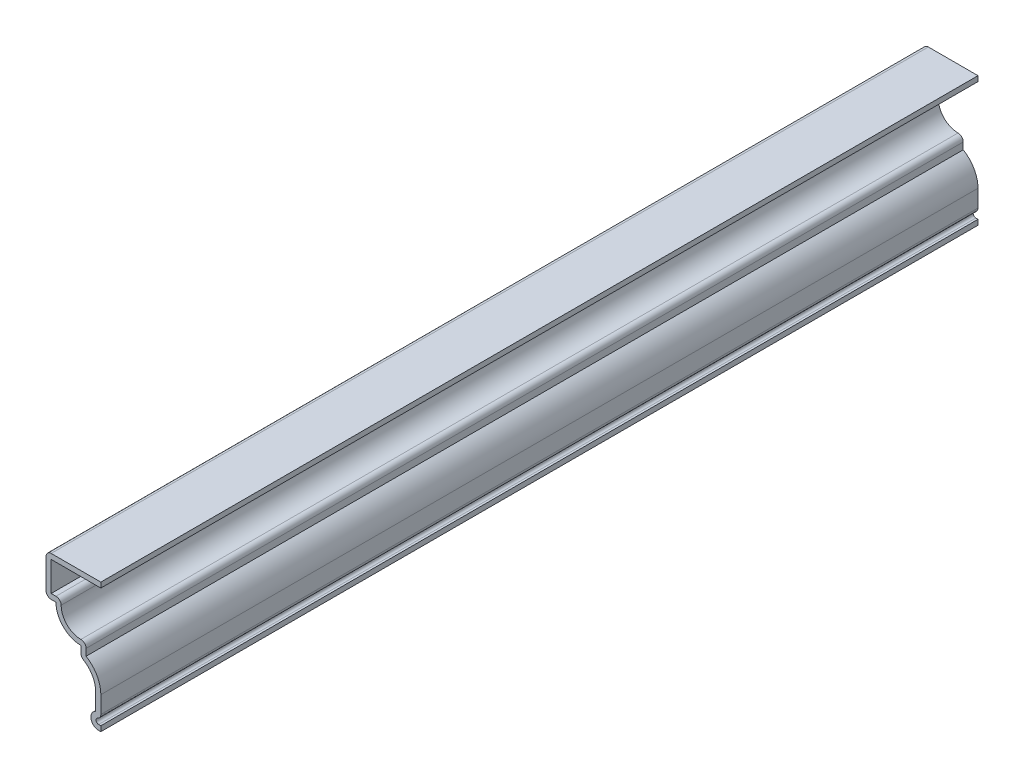
ISO-10303-21;
HEADER;
FILE_DESCRIPTION(('STEP AP214'),'2;1');
FILE_NAME('part.step','',(''),(''),'','','');
FILE_SCHEMA(('AUTOMOTIVE_DESIGN { 1 0 10303 214 1 1 1 1 }'));
ENDSEC;
DATA;
#1=APPLICATION_CONTEXT('core data for automotive mechanical design processes');
#2=APPLICATION_PROTOCOL_DEFINITION('international standard','automotive_design',2000,#1);
#3=PRODUCT_CONTEXT('',#1,'mechanical');
#4=PRODUCT('Part','Part','',(#3));
#5=PRODUCT_RELATED_PRODUCT_CATEGORY('part','',(#4));
#6=PRODUCT_DEFINITION_FORMATION('','',#4);
#7=PRODUCT_DEFINITION_CONTEXT('part definition',#1,'design');
#8=PRODUCT_DEFINITION('design','',#6,#7);
#9=PRODUCT_DEFINITION_SHAPE('','',#8);
#10=(LENGTH_UNIT() NAMED_UNIT(*) SI_UNIT(.MILLI.,.METRE.));
#11=(NAMED_UNIT(*) PLANE_ANGLE_UNIT() SI_UNIT($,.RADIAN.));
#12=(NAMED_UNIT(*) SI_UNIT($,.STERADIAN.) SOLID_ANGLE_UNIT());
#13=UNCERTAINTY_MEASURE_WITH_UNIT(LENGTH_MEASURE(1.E-05),#10,'distance_accuracy_value','');
#14=(GEOMETRIC_REPRESENTATION_CONTEXT(3) GLOBAL_UNCERTAINTY_ASSIGNED_CONTEXT((#13)) GLOBAL_UNIT_ASSIGNED_CONTEXT((#10,
#11,#12)) REPRESENTATION_CONTEXT('',''));
#15=CARTESIAN_POINT('',(0.,0.,0.));
#16=DIRECTION('',(0.,0.,1.));
#17=DIRECTION('',(1.,0.,0.));
#18=AXIS2_PLACEMENT_3D('',#15,#16,#17);
#19=CARTESIAN_POINT('',(-17.4625,39.624,-279.4));
#20=DIRECTION('',(0.,-1.,0.));
#21=DIRECTION('',(0.,0.,-1.));
#22=AXIS2_PLACEMENT_3D('',#19,#20,#21);
#23=PLANE('',#22);
#24=DIRECTION('',(1.,0.,0.));
#25=VECTOR('',#24,1.);
#26=CARTESIAN_POINT('',(-17.4625,39.624,0.));
#27=LINE('',#26,#25);
#28=CARTESIAN_POINT('',(-15.8115,39.624,0.));
#29=VERTEX_POINT('',#28);
#30=CARTESIAN_POINT('',(0.,39.624,0.));
#31=VERTEX_POINT('',#30);
#32=EDGE_CURVE('E281',#29,#31,#27,.T.);
#33=ORIENTED_EDGE('',*,*,#32,.F.);
#34=DIRECTION('',(0.,0.,1.));
#35=VECTOR('',#34,1.);
#36=CARTESIAN_POINT('',(-15.8115,39.624,-279.4));
#37=LINE('',#36,#35);
#38=CARTESIAN_POINT('',(-15.8115,39.624,-279.4));
#39=VERTEX_POINT('',#38);
#40=EDGE_CURVE('E233',#39,#29,#37,.T.);
#41=ORIENTED_EDGE('',*,*,#40,.F.);
#42=DIRECTION('',(1.,0.,0.));
#43=VECTOR('',#42,1.);
#44=CARTESIAN_POINT('',(-17.4625,39.624,-279.4));
#45=LINE('',#44,#43);
#46=CARTESIAN_POINT('',(0.,39.624,-279.4));
#47=VERTEX_POINT('',#46);
#48=EDGE_CURVE('E215',#39,#47,#45,.T.);
#49=ORIENTED_EDGE('',*,*,#48,.T.);
#50=DIRECTION('',(0.,0.,1.));
#51=VECTOR('',#50,1.);
#52=CARTESIAN_POINT('',(0.,39.624,-279.4));
#53=LINE('',#52,#51);
#54=EDGE_CURVE('E223',#47,#31,#53,.T.);
#55=ORIENTED_EDGE('',*,*,#54,.T.);
#56=EDGE_LOOP('',(#33,#41,#49,#55));
#57=FACE_BOUND('',#56,.T.);
#58=ADVANCED_FACE('F35',(#57),#23,.T.);
#59=CARTESIAN_POINT('',(-15.8115,28.575,-279.4));
#60=DIRECTION('',(1.,0.,0.));
#61=DIRECTION('',(0.,0.,-1.));
#62=AXIS2_PLACEMENT_3D('',#59,#60,#61);
#63=PLANE('',#62);
#64=DIRECTION('',(0.,1.,0.));
#65=VECTOR('',#64,1.);
#66=CARTESIAN_POINT('',(-15.8115,28.575,0.));
#67=LINE('',#66,#65);
#68=CARTESIAN_POINT('',(-15.8115,30.226,0.));
#69=VERTEX_POINT('',#68);
#70=EDGE_CURVE('E234',#69,#29,#67,.T.);
#71=ORIENTED_EDGE('',*,*,#70,.F.);
#72=DIRECTION('',(0.,0.,1.));
#73=VECTOR('',#72,1.);
#74=CARTESIAN_POINT('',(-15.8115,30.226,-279.4));
#75=LINE('',#74,#73);
#76=CARTESIAN_POINT('',(-15.8115,30.226,-279.4));
#77=VERTEX_POINT('',#76);
#78=EDGE_CURVE('E326',#77,#69,#75,.T.);
#79=ORIENTED_EDGE('',*,*,#78,.F.);
#80=DIRECTION('',(0.,1.,0.));
#81=VECTOR('',#80,1.);
#82=CARTESIAN_POINT('',(-15.8115,28.575,-279.4));
#83=LINE('',#82,#81);
#84=EDGE_CURVE('E231',#77,#39,#83,.T.);
#85=ORIENTED_EDGE('',*,*,#84,.T.);
#86=ORIENTED_EDGE('',*,*,#40,.T.);
#87=EDGE_LOOP('',(#71,#79,#85,#86));
#88=FACE_BOUND('',#87,.T.);
#89=ADVANCED_FACE('F426',(#88),#63,.T.);
#90=CARTESIAN_POINT('',(-14.2875,30.226,-279.4));
#91=DIRECTION('',(0.,1.,0.));
#92=DIRECTION('',(0.,0.,1.));
#93=AXIS2_PLACEMENT_3D('',#90,#91,#92);
#94=PLANE('',#93);
#95=DIRECTION('',(1.,0.,0.));
#96=VECTOR('',#95,1.);
#97=CARTESIAN_POINT('',(-14.2875,30.226,0.));
#98=LINE('',#97,#96);
#99=CARTESIAN_POINT('',(-14.2875,30.226,0.));
#100=VERTEX_POINT('',#99);
#101=EDGE_CURVE('E237',#100,#69,#98,.F.);
#102=ORIENTED_EDGE('',*,*,#101,.F.);
#103=DIRECTION('',(0.,0.,1.));
#104=VECTOR('',#103,1.);
#105=CARTESIAN_POINT('',(-14.2875,30.226,-279.4));
#106=LINE('',#105,#104);
#107=CARTESIAN_POINT('',(-14.2875,30.226,-279.4));
#108=VERTEX_POINT('',#107);
#109=EDGE_CURVE('E397',#100,#108,#106,.F.);
#110=ORIENTED_EDGE('',*,*,#109,.T.);
#111=DIRECTION('',(1.,0.,0.));
#112=VECTOR('',#111,1.);
#113=CARTESIAN_POINT('',(-14.2875,30.226,-279.4));
#114=LINE('',#113,#112);
#115=EDGE_CURVE('E278',#108,#77,#114,.F.);
#116=ORIENTED_EDGE('',*,*,#115,.T.);
#117=ORIENTED_EDGE('',*,*,#78,.T.);
#118=EDGE_LOOP('',(#102,#110,#116,#117));
#119=FACE_BOUND('',#118,.T.);
#120=ADVANCED_FACE('F518',(#119),#94,.T.);
#121=CARTESIAN_POINT('',(-6.34999999999999,28.575,-279.4));
#122=DIRECTION('',(0.,0.,1.));
#123=DIRECTION('',(1.,0.,0.));
#124=AXIS2_PLACEMENT_3D('',#121,#122,#123);
#125=CYLINDRICAL_SURFACE('',#124,6.2865);
#126=CARTESIAN_POINT('',(-6.34999999999999,28.575,0.));
#127=DIRECTION('',(0.,0.,1.));
#128=DIRECTION('',(1.,0.,0.));
#129=AXIS2_PLACEMENT_3D('',#126,#127,#128);
#130=CIRCLE('',#129,6.2865);
#131=CARTESIAN_POINT('',(-6.34999999999999,22.2885,0.));
#132=VERTEX_POINT('',#131);
#133=CARTESIAN_POINT('',(-12.6365,28.575,0.));
#134=VERTEX_POINT('',#133);
#135=EDGE_CURVE('E320',#132,#134,#130,.F.);
#136=ORIENTED_EDGE('',*,*,#135,.F.);
#137=DIRECTION('',(0.,0.,1.));
#138=VECTOR('',#137,1.);
#139=CARTESIAN_POINT('',(-6.34999999999999,22.2885,-279.4));
#140=LINE('',#139,#138);
#141=CARTESIAN_POINT('',(-6.34999999999999,22.2885,-279.4));
#142=VERTEX_POINT('',#141);
#143=EDGE_CURVE('E395',#132,#142,#140,.F.);
#144=ORIENTED_EDGE('',*,*,#143,.T.);
#145=CARTESIAN_POINT('',(-6.34999999999999,28.575,-279.4));
#146=DIRECTION('',(0.,0.,1.));
#147=DIRECTION('',(1.,0.,0.));
#148=AXIS2_PLACEMENT_3D('',#145,#146,#147);
#149=CIRCLE('',#148,6.2865);
#150=CARTESIAN_POINT('',(-12.6365,28.575,-279.4));
#151=VERTEX_POINT('',#150);
#152=EDGE_CURVE('E275',#142,#151,#149,.F.);
#153=ORIENTED_EDGE('',*,*,#152,.T.);
#154=DIRECTION('',(0.,0.,1.));
#155=VECTOR('',#154,1.);
#156=CARTESIAN_POINT('',(-12.6365,28.575,-279.4));
#157=LINE('',#156,#155);
#158=EDGE_CURVE('E392',#151,#134,#157,.T.);
#159=ORIENTED_EDGE('',*,*,#158,.T.);
#160=EDGE_LOOP('',(#136,#144,#153,#159));
#161=FACE_BOUND('',#160,.T.);
#162=ADVANCED_FACE('F437',(#161),#125,.F.);
#163=CARTESIAN_POINT('',(-4.69899999999999,17.4625,-279.4));
#164=DIRECTION('',(1.,0.,0.));
#165=DIRECTION('',(0.,0.,-1.));
#166=AXIS2_PLACEMENT_3D('',#163,#164,#165);
#167=PLANE('',#166);
#168=DIRECTION('',(0.,1.,0.));
#169=VECTOR('',#168,1.);
#170=CARTESIAN_POINT('',(-4.69899999999999,17.4625,-279.4));
#171=LINE('',#170,#169);
#172=CARTESIAN_POINT('',(-4.699,18.4638646538287,-279.4));
#173=VERTEX_POINT('',#172);
#174=CARTESIAN_POINT('',(-4.69899999999999,20.6375,-279.4));
#175=VERTEX_POINT('',#174);
#176=EDGE_CURVE('E272',#173,#175,#171,.T.);
#177=ORIENTED_EDGE('',*,*,#176,.T.);
#178=DIRECTION('',(0.,0.,1.));
#179=VECTOR('',#178,1.);
#180=CARTESIAN_POINT('',(-4.69899999999999,20.6375,-279.4));
#181=LINE('',#180,#179);
#182=CARTESIAN_POINT('',(-4.69899999999999,20.6375,0.));
#183=VERTEX_POINT('',#182);
#184=EDGE_CURVE('E389',#175,#183,#181,.T.);
#185=ORIENTED_EDGE('',*,*,#184,.T.);
#186=DIRECTION('',(0.,1.,0.));
#187=VECTOR('',#186,1.);
#188=CARTESIAN_POINT('',(-4.69899999999999,17.4625,0.));
#189=LINE('',#188,#187);
#190=CARTESIAN_POINT('',(-4.699,18.4638646538287,0.));
#191=VERTEX_POINT('',#190);
#192=EDGE_CURVE('E317',#191,#183,#189,.T.);
#193=ORIENTED_EDGE('',*,*,#192,.F.);
#194=DIRECTION('',(0.,0.,1.));
#195=VECTOR('',#194,1.);
#196=CARTESIAN_POINT('',(-4.699,18.4638646538287,-279.4));
#197=LINE('',#196,#195);
#198=EDGE_CURVE('E329',#173,#191,#197,.T.);
#199=ORIENTED_EDGE('',*,*,#198,.F.);
#200=EDGE_LOOP('',(#177,#185,#193,#199));
#201=FACE_BOUND('',#200,.T.);
#202=ADVANCED_FACE('F445',(#201),#167,.T.);
#203=CARTESIAN_POINT('',(-9.5885,10.2157059502149,-279.4));
#204=DIRECTION('',(0.,0.,1.));
#205=DIRECTION('',(1.,0.,0.));
#206=AXIS2_PLACEMENT_3D('',#203,#204,#205);
#207=CYLINDRICAL_SURFACE('',#206,9.5885);
#208=CARTESIAN_POINT('',(-9.5885,10.2157059502149,0.));
#209=DIRECTION('',(0.,0.,1.));
#210=DIRECTION('',(1.,0.,0.));
#211=AXIS2_PLACEMENT_3D('',#208,#209,#210);
#212=CIRCLE('',#211,9.5885);
#213=CARTESIAN_POINT('',(0.,10.2157059502149,0.));
#214=VERTEX_POINT('',#213);
#215=EDGE_CURVE('E314',#214,#191,#212,.T.);
#216=ORIENTED_EDGE('',*,*,#215,.F.);
#217=DIRECTION('',(0.,0.,1.));
#218=VECTOR('',#217,1.);
#219=CARTESIAN_POINT('',(0.,10.2157059502149,-279.4));
#220=LINE('',#219,#218);
#221=CARTESIAN_POINT('',(0.,10.2157059502149,-279.4));
#222=VERTEX_POINT('',#221);
#223=EDGE_CURVE('E331',#222,#214,#220,.T.);
#224=ORIENTED_EDGE('',*,*,#223,.F.);
#225=CARTESIAN_POINT('',(-9.5885,10.2157059502149,-279.4));
#226=DIRECTION('',(0.,0.,1.));
#227=DIRECTION('',(1.,0.,0.));
#228=AXIS2_PLACEMENT_3D('',#225,#226,#227);
#229=CIRCLE('',#228,9.5885);
#230=EDGE_CURVE('E269',#222,#173,#229,.T.);
#231=ORIENTED_EDGE('',*,*,#230,.T.);
#232=ORIENTED_EDGE('',*,*,#198,.T.);
#233=EDGE_LOOP('',(#216,#224,#231,#232));
#234=FACE_BOUND('',#233,.T.);
#235=ADVANCED_FACE('F451',(#234),#207,.T.);
#236=CARTESIAN_POINT('',(0.,4.7625,-279.4));
#237=DIRECTION('',(1.,0.,0.));
#238=DIRECTION('',(0.,1.,0.));
#239=AXIS2_PLACEMENT_3D('',#236,#237,#238);
#240=PLANE('',#239);
#241=DIRECTION('',(0.,1.,0.));
#242=VECTOR('',#241,1.);
#243=CARTESIAN_POINT('',(0.,4.7625,0.));
#244=LINE('',#243,#242);
#245=CARTESIAN_POINT('',(0.,4.7625,0.));
#246=VERTEX_POINT('',#245);
#247=EDGE_CURVE('E312',#246,#214,#244,.T.);
#248=ORIENTED_EDGE('',*,*,#247,.F.);
#249=DIRECTION('',(0.,0.,1.));
#250=VECTOR('',#249,1.);
#251=CARTESIAN_POINT('',(0.,4.7625,-279.4));
#252=LINE('',#251,#250);
#253=CARTESIAN_POINT('',(0.,4.7625,-279.4));
#254=VERTEX_POINT('',#253);
#255=EDGE_CURVE('E371',#246,#254,#252,.F.);
#256=ORIENTED_EDGE('',*,*,#255,.T.);
#257=DIRECTION('',(0.,1.,0.));
#258=VECTOR('',#257,1.);
#259=CARTESIAN_POINT('',(0.,4.7625,-279.4));
#260=LINE('',#259,#258);
#261=EDGE_CURVE('E267',#254,#222,#260,.T.);
#262=ORIENTED_EDGE('',*,*,#261,.T.);
#263=ORIENTED_EDGE('',*,*,#223,.T.);
#264=EDGE_LOOP('',(#248,#256,#262,#263));
#265=FACE_BOUND('',#264,.T.);
#266=ADVANCED_FACE('F454',(#265),#240,.T.);
#267=CARTESIAN_POINT('',(-0.698499999999999,2.4765,-279.4));
#268=DIRECTION('',(0.,0.,1.));
#269=DIRECTION('',(1.,0.,0.));
#270=AXIS2_PLACEMENT_3D('',#267,#268,#269);
#271=CYLINDRICAL_SURFACE('',#270,0.8255);
#272=CARTESIAN_POINT('',(-0.698499999999999,2.4765,-279.4));
#273=DIRECTION('',(0.,0.,1.));
#274=DIRECTION('',(1.,0.,0.));
#275=AXIS2_PLACEMENT_3D('',#272,#273,#274);
#276=CIRCLE('',#275,0.8255);
#277=CARTESIAN_POINT('',(-0.698499999999999,1.651,-279.4));
#278=VERTEX_POINT('',#277);
#279=CARTESIAN_POINT('',(-1.016,3.2385,-279.4));
#280=VERTEX_POINT('',#279);
#281=EDGE_CURVE('E264',#278,#280,#276,.F.);
#282=ORIENTED_EDGE('',*,*,#281,.T.);
#283=DIRECTION('',(0.,0.,1.));
#284=VECTOR('',#283,1.);
#285=CARTESIAN_POINT('',(-1.016,3.2385,-279.4));
#286=LINE('',#285,#284);
#287=CARTESIAN_POINT('',(-1.016,3.2385,0.));
#288=VERTEX_POINT('',#287);
#289=EDGE_CURVE('E325',#280,#288,#286,.T.);
#290=ORIENTED_EDGE('',*,*,#289,.T.);
#291=CARTESIAN_POINT('',(-0.698499999999999,2.4765,0.));
#292=DIRECTION('',(0.,0.,1.));
#293=DIRECTION('',(1.,0.,0.));
#294=AXIS2_PLACEMENT_3D('',#291,#292,#293);
#295=CIRCLE('',#294,0.8255);
#296=CARTESIAN_POINT('',(-0.698499999999999,1.651,0.));
#297=VERTEX_POINT('',#296);
#298=EDGE_CURVE('E309',#297,#288,#295,.F.);
#299=ORIENTED_EDGE('',*,*,#298,.F.);
#300=DIRECTION('',(0.,0.,1.));
#301=VECTOR('',#300,1.);
#302=CARTESIAN_POINT('',(-0.698499999999999,1.651,-279.4));
#303=LINE('',#302,#301);
#304=EDGE_CURVE('E334',#278,#297,#303,.T.);
#305=ORIENTED_EDGE('',*,*,#304,.F.);
#306=EDGE_LOOP('',(#282,#290,#299,#305));
#307=FACE_BOUND('',#306,.T.);
#308=ADVANCED_FACE('F463',(#307),#271,.F.);
#309=CARTESIAN_POINT('',(-0.698499999999999,1.651,-279.4));
#310=DIRECTION('',(0.,1.,0.));
#311=DIRECTION('',(0.,0.,1.));
#312=AXIS2_PLACEMENT_3D('',#309,#310,#311);
#313=PLANE('',#312);
#314=DIRECTION('',(1.,0.,0.));
#315=VECTOR('',#314,1.);
#316=CARTESIAN_POINT('',(-0.698499999999999,1.651,0.));
#317=LINE('',#316,#315);
#318=CARTESIAN_POINT('',(0.,1.651,0.));
#319=VERTEX_POINT('',#318);
#320=EDGE_CURVE('E306',#319,#297,#317,.F.);
#321=ORIENTED_EDGE('',*,*,#320,.F.);
#322=DIRECTION('',(0.,0.,1.));
#323=VECTOR('',#322,1.);
#324=CARTESIAN_POINT('',(0.,1.651,-279.4));
#325=LINE('',#324,#323);
#326=CARTESIAN_POINT('',(0.,1.651,-279.4));
#327=VERTEX_POINT('',#326);
#328=EDGE_CURVE('E336',#327,#319,#325,.T.);
#329=ORIENTED_EDGE('',*,*,#328,.F.);
#330=DIRECTION('',(1.,0.,0.));
#331=VECTOR('',#330,1.);
#332=CARTESIAN_POINT('',(-0.698499999999999,1.651,-279.4));
#333=LINE('',#332,#331);
#334=EDGE_CURVE('E261',#327,#278,#333,.F.);
#335=ORIENTED_EDGE('',*,*,#334,.T.);
#336=ORIENTED_EDGE('',*,*,#304,.T.);
#337=EDGE_LOOP('',(#321,#329,#335,#336));
#338=FACE_BOUND('',#337,.T.);
#339=ADVANCED_FACE('F468',(#338),#313,.T.);
#340=CARTESIAN_POINT('',(0.,1.651,-279.4));
#341=DIRECTION('',(-1.,0.,0.));
#342=DIRECTION('',(0.,-1.,0.));
#343=AXIS2_PLACEMENT_3D('',#340,#341,#342);
#344=PLANE('',#343);
#345=DIRECTION('',(0.,-1.,0.));
#346=VECTOR('',#345,1.);
#347=CARTESIAN_POINT('',(0.,1.651,0.));
#348=LINE('',#347,#346);
#349=CARTESIAN_POINT('',(0.,0.,0.));
#350=VERTEX_POINT('',#349);
#351=EDGE_CURVE('E304',#319,#350,#348,.T.);
#352=ORIENTED_EDGE('',*,*,#351,.T.);
#353=DIRECTION('',(0.,0.,1.));
#354=VECTOR('',#353,1.);
#355=CARTESIAN_POINT('',(0.,0.,-279.4));
#356=LINE('',#355,#354);
#357=CARTESIAN_POINT('',(0.,0.,-279.4));
#358=VERTEX_POINT('',#357);
#359=EDGE_CURVE('E338',#358,#350,#356,.T.);
#360=ORIENTED_EDGE('',*,*,#359,.F.);
#361=DIRECTION('',(0.,-1.,0.));
#362=VECTOR('',#361,1.);
#363=CARTESIAN_POINT('',(0.,1.651,-279.4));
#364=LINE('',#363,#362);
#365=EDGE_CURVE('E259',#327,#358,#364,.T.);
#366=ORIENTED_EDGE('',*,*,#365,.F.);
#367=ORIENTED_EDGE('',*,*,#328,.T.);
#368=EDGE_LOOP('',(#352,#360,#366,#367));
#369=FACE_BOUND('',#368,.T.);
#370=ADVANCED_FACE('F475',(#369),#344,.F.);
#371=CARTESIAN_POINT('',(-0.698499999999999,0.,-279.4));
#372=DIRECTION('',(0.,1.,0.));
#373=DIRECTION('',(0.,0.,1.));
#374=AXIS2_PLACEMENT_3D('',#371,#372,#373);
#375=PLANE('',#374);
#376=DIRECTION('',(-1.,0.,0.));
#377=VECTOR('',#376,1.);
#378=CARTESIAN_POINT('',(-0.698499999999999,0.,0.));
#379=LINE('',#378,#377);
#380=CARTESIAN_POINT('',(-0.698499999999999,0.,0.));
#381=VERTEX_POINT('',#380);
#382=EDGE_CURVE('E302',#350,#381,#379,.T.);
#383=ORIENTED_EDGE('',*,*,#382,.T.);
#384=DIRECTION('',(0.,0.,1.));
#385=VECTOR('',#384,1.);
#386=CARTESIAN_POINT('',(-0.698499999999999,0.,-279.4));
#387=LINE('',#386,#385);
#388=CARTESIAN_POINT('',(-0.698499999999999,0.,-279.4));
#389=VERTEX_POINT('',#388);
#390=EDGE_CURVE('E341',#389,#381,#387,.T.);
#391=ORIENTED_EDGE('',*,*,#390,.F.);
#392=DIRECTION('',(-1.,0.,0.));
#393=VECTOR('',#392,1.);
#394=CARTESIAN_POINT('',(-0.698499999999999,0.,-279.4));
#395=LINE('',#394,#393);
#396=EDGE_CURVE('E257',#358,#389,#395,.T.);
#397=ORIENTED_EDGE('',*,*,#396,.F.);
#398=ORIENTED_EDGE('',*,*,#359,.T.);
#399=EDGE_LOOP('',(#383,#391,#397,#398));
#400=FACE_BOUND('',#399,.T.);
#401=ADVANCED_FACE('F477',(#400),#375,.F.);
#402=CARTESIAN_POINT('',(-0.698499999999999,2.4765,-279.4));
#403=DIRECTION('',(0.,0.,1.));
#404=DIRECTION('',(1.,0.,0.));
#405=AXIS2_PLACEMENT_3D('',#402,#403,#404);
#406=CYLINDRICAL_SURFACE('',#405,2.4765);
#407=CARTESIAN_POINT('',(-0.698499999999999,2.4765,0.));
#408=DIRECTION('',(0.,0.,-1.));
#409=DIRECTION('',(1.,0.,0.));
#410=AXIS2_PLACEMENT_3D('',#407,#408,#409);
#411=CIRCLE('',#410,2.4765);
#412=CARTESIAN_POINT('',(-1.651,4.7625,0.));
#413=VERTEX_POINT('',#412);
#414=EDGE_CURVE('E300',#381,#413,#411,.T.);
#415=ORIENTED_EDGE('',*,*,#414,.T.);
#416=DIRECTION('',(0.,0.,1.));
#417=VECTOR('',#416,1.);
#418=CARTESIAN_POINT('',(-1.651,4.7625,-279.4));
#419=LINE('',#418,#417);
#420=CARTESIAN_POINT('',(-1.651,4.7625,-279.4));
#421=VERTEX_POINT('',#420);
#422=EDGE_CURVE('E344',#421,#413,#419,.T.);
#423=ORIENTED_EDGE('',*,*,#422,.F.);
#424=CARTESIAN_POINT('',(-0.698499999999999,2.4765,-279.4));
#425=DIRECTION('',(0.,0.,-1.));
#426=DIRECTION('',(1.,0.,0.));
#427=AXIS2_PLACEMENT_3D('',#424,#425,#426);
#428=CIRCLE('',#427,2.4765);
#429=EDGE_CURVE('E255',#389,#421,#428,.T.);
#430=ORIENTED_EDGE('',*,*,#429,.F.);
#431=ORIENTED_EDGE('',*,*,#390,.T.);
#432=EDGE_LOOP('',(#415,#423,#430,#431));
#433=FACE_BOUND('',#432,.T.);
#434=ADVANCED_FACE('F482',(#433),#406,.T.);
#435=CARTESIAN_POINT('',(-1.651,4.7625,-279.4));
#436=DIRECTION('',(1.,0.,0.));
#437=DIRECTION('',(0.,1.,0.));
#438=AXIS2_PLACEMENT_3D('',#435,#436,#437);
#439=PLANE('',#438);
#440=DIRECTION('',(0.,1.,0.));
#441=VECTOR('',#440,1.);
#442=CARTESIAN_POINT('',(-1.651,4.7625,0.));
#443=LINE('',#442,#441);
#444=CARTESIAN_POINT('',(-1.651,10.2157059502149,0.));
#445=VERTEX_POINT('',#444);
#446=EDGE_CURVE('E298',#413,#445,#443,.T.);
#447=ORIENTED_EDGE('',*,*,#446,.T.);
#448=DIRECTION('',(0.,0.,1.));
#449=VECTOR('',#448,1.);
#450=CARTESIAN_POINT('',(-1.651,10.2157059502149,-279.4));
#451=LINE('',#450,#449);
#452=CARTESIAN_POINT('',(-1.651,10.2157059502149,-279.4));
#453=VERTEX_POINT('',#452);
#454=EDGE_CURVE('E347',#453,#445,#451,.T.);
#455=ORIENTED_EDGE('',*,*,#454,.F.);
#456=DIRECTION('',(0.,1.,0.));
#457=VECTOR('',#456,1.);
#458=CARTESIAN_POINT('',(-1.651,4.7625,-279.4));
#459=LINE('',#458,#457);
#460=EDGE_CURVE('E253',#421,#453,#459,.T.);
#461=ORIENTED_EDGE('',*,*,#460,.F.);
#462=ORIENTED_EDGE('',*,*,#422,.T.);
#463=EDGE_LOOP('',(#447,#455,#461,#462));
#464=FACE_BOUND('',#463,.T.);
#465=ADVANCED_FACE('F488',(#464),#439,.F.);
#466=CARTESIAN_POINT('',(-9.5885,10.2157059502149,-279.4));
#467=DIRECTION('',(0.,0.,1.));
#468=DIRECTION('',(1.,0.,0.));
#469=AXIS2_PLACEMENT_3D('',#466,#467,#468);
#470=CYLINDRICAL_SURFACE('',#469,7.9375);
#471=CARTESIAN_POINT('',(-9.5885,10.2157059502149,0.));
#472=DIRECTION('',(0.,0.,1.));
#473=DIRECTION('',(1.,0.,0.));
#474=AXIS2_PLACEMENT_3D('',#471,#472,#473);
#475=CIRCLE('',#474,7.9375);
#476=CARTESIAN_POINT('',(-5.54090066225165,17.0436518969151,0.));
#477=VERTEX_POINT('',#476);
#478=EDGE_CURVE('E295',#445,#477,#475,.T.);
#479=ORIENTED_EDGE('',*,*,#478,.T.);
#480=DIRECTION('',(0.,0.,1.));
#481=VECTOR('',#480,1.);
#482=CARTESIAN_POINT('',(-5.54090066225165,17.0436518969151,-279.4));
#483=LINE('',#482,#481);
#484=CARTESIAN_POINT('',(-5.54090066225165,17.0436518969151,-279.4));
#485=VERTEX_POINT('',#484);
#486=EDGE_CURVE('E387',#477,#485,#483,.F.);
#487=ORIENTED_EDGE('',*,*,#486,.T.);
#488=CARTESIAN_POINT('',(-9.5885,10.2157059502149,-279.4));
#489=DIRECTION('',(0.,0.,1.));
#490=DIRECTION('',(1.,0.,0.));
#491=AXIS2_PLACEMENT_3D('',#488,#489,#490);
#492=CIRCLE('',#491,7.9375);
#493=EDGE_CURVE('E250',#453,#485,#492,.T.);
#494=ORIENTED_EDGE('',*,*,#493,.F.);
#495=ORIENTED_EDGE('',*,*,#454,.T.);
#496=EDGE_LOOP('',(#479,#487,#494,#495));
#497=FACE_BOUND('',#496,.T.);
#498=ADVANCED_FACE('F492',(#497),#470,.F.);
#499=CARTESIAN_POINT('',(-6.34999999999999,17.4625,-279.4));
#500=DIRECTION('',(1.,0.,0.));
#501=DIRECTION('',(0.,0.,-1.));
#502=AXIS2_PLACEMENT_3D('',#499,#500,#501);
#503=PLANE('',#502);
#504=DIRECTION('',(0.,1.,0.));
#505=VECTOR('',#504,1.);
#506=CARTESIAN_POINT('',(-6.34999999999999,17.4625,-279.4));
#507=LINE('',#506,#505);
#508=CARTESIAN_POINT('',(-6.34999999999999,18.4638646538287,-279.4));
#509=VERTEX_POINT('',#508);
#510=CARTESIAN_POINT('',(-6.34999999999999,20.6375,-279.4));
#511=VERTEX_POINT('',#510);
#512=EDGE_CURVE('E248',#509,#511,#507,.T.);
#513=ORIENTED_EDGE('',*,*,#512,.F.);
#514=DIRECTION('',(0.,0.,1.));
#515=VECTOR('',#514,1.);
#516=CARTESIAN_POINT('',(-6.34999999999999,18.4638646538287,-279.4));
#517=LINE('',#516,#515);
#518=CARTESIAN_POINT('',(-6.34999999999999,18.4638646538287,0.));
#519=VERTEX_POINT('',#518);
#520=EDGE_CURVE('E384',#509,#519,#517,.T.);
#521=ORIENTED_EDGE('',*,*,#520,.T.);
#522=DIRECTION('',(0.,1.,0.));
#523=VECTOR('',#522,1.);
#524=CARTESIAN_POINT('',(-6.34999999999999,17.4625,0.));
#525=LINE('',#524,#523);
#526=CARTESIAN_POINT('',(-6.34999999999999,20.6375,0.));
#527=VERTEX_POINT('',#526);
#528=EDGE_CURVE('E293',#519,#527,#525,.T.);
#529=ORIENTED_EDGE('',*,*,#528,.T.);
#530=DIRECTION('',(0.,0.,1.));
#531=VECTOR('',#530,1.);
#532=CARTESIAN_POINT('',(-6.34999999999999,20.6375,-279.4));
#533=LINE('',#532,#531);
#534=EDGE_CURVE('E350',#511,#527,#533,.T.);
#535=ORIENTED_EDGE('',*,*,#534,.F.);
#536=EDGE_LOOP('',(#513,#521,#529,#535));
#537=FACE_BOUND('',#536,.T.);
#538=ADVANCED_FACE('F500',(#537),#503,.F.);
#539=CARTESIAN_POINT('',(-6.34999999999999,28.575,-279.4));
#540=DIRECTION('',(0.,0.,1.));
#541=DIRECTION('',(1.,0.,0.));
#542=AXIS2_PLACEMENT_3D('',#539,#540,#541);
#543=CYLINDRICAL_SURFACE('',#542,7.9375);
#544=CARTESIAN_POINT('',(-6.34999999999999,28.575,0.));
#545=DIRECTION('',(0.,0.,-1.));
#546=DIRECTION('',(-1.,0.,0.));
#547=AXIS2_PLACEMENT_3D('',#544,#545,#546);
#548=CIRCLE('',#547,7.9375);
#549=CARTESIAN_POINT('',(-14.2875,28.575,0.));
#550=VERTEX_POINT('',#549);
#551=EDGE_CURVE('E291',#527,#550,#548,.T.);
#552=ORIENTED_EDGE('',*,*,#551,.T.);
#553=DIRECTION('',(0.,0.,1.));
#554=VECTOR('',#553,1.);
#555=CARTESIAN_POINT('',(-14.2875,28.575,-279.4));
#556=LINE('',#555,#554);
#557=CARTESIAN_POINT('',(-14.2875,28.575,-279.4));
#558=VERTEX_POINT('',#557);
#559=EDGE_CURVE('E353',#558,#550,#556,.T.);
#560=ORIENTED_EDGE('',*,*,#559,.F.);
#561=CARTESIAN_POINT('',(-6.34999999999999,28.575,-279.4));
#562=DIRECTION('',(0.,0.,-1.));
#563=DIRECTION('',(-1.,0.,0.));
#564=AXIS2_PLACEMENT_3D('',#561,#562,#563);
#565=CIRCLE('',#564,7.9375);
#566=EDGE_CURVE('E246',#511,#558,#565,.T.);
#567=ORIENTED_EDGE('',*,*,#566,.F.);
#568=ORIENTED_EDGE('',*,*,#534,.T.);
#569=EDGE_LOOP('',(#552,#560,#567,#568));
#570=FACE_BOUND('',#569,.T.);
#571=ADVANCED_FACE('F504',(#570),#543,.T.);
#572=CARTESIAN_POINT('',(-14.2875,28.575,-279.4));
#573=DIRECTION('',(0.,1.,0.));
#574=DIRECTION('',(0.,0.,1.));
#575=AXIS2_PLACEMENT_3D('',#572,#573,#574);
#576=PLANE('',#575);
#577=DIRECTION('',(-1.,0.,0.));
#578=VECTOR('',#577,1.);
#579=CARTESIAN_POINT('',(-14.2875,28.575,0.));
#580=LINE('',#579,#578);
#581=CARTESIAN_POINT('',(-15.8115,28.575,0.));
#582=VERTEX_POINT('',#581);
#583=EDGE_CURVE('E288',#550,#582,#580,.T.);
#584=ORIENTED_EDGE('',*,*,#583,.T.);
#585=DIRECTION('',(0.,0.,1.));
#586=VECTOR('',#585,1.);
#587=CARTESIAN_POINT('',(-15.8115,28.575,-279.4));
#588=LINE('',#587,#586);
#589=CARTESIAN_POINT('',(-15.8115,28.575,-279.4));
#590=VERTEX_POINT('',#589);
#591=EDGE_CURVE('E43',#582,#590,#588,.F.);
#592=ORIENTED_EDGE('',*,*,#591,.T.);
#593=DIRECTION('',(-1.,0.,0.));
#594=VECTOR('',#593,1.);
#595=CARTESIAN_POINT('',(-14.2875,28.575,-279.4));
#596=LINE('',#595,#594);
#597=EDGE_CURVE('E243',#558,#590,#596,.T.);
#598=ORIENTED_EDGE('',*,*,#597,.F.);
#599=ORIENTED_EDGE('',*,*,#559,.T.);
#600=EDGE_LOOP('',(#584,#592,#598,#599));
#601=FACE_BOUND('',#600,.T.);
#602=ADVANCED_FACE('F405',(#601),#576,.F.);
#603=CARTESIAN_POINT('',(-17.4625,28.575,-279.4));
#604=DIRECTION('',(1.,0.,0.));
#605=DIRECTION('',(0.,0.,-1.));
#606=AXIS2_PLACEMENT_3D('',#603,#604,#605);
#607=PLANE('',#606);
#608=DIRECTION('',(0.,1.,0.));
#609=VECTOR('',#608,1.);
#610=CARTESIAN_POINT('',(-17.4625,28.575,-279.4));
#611=LINE('',#610,#609);
#612=CARTESIAN_POINT('',(-17.4625,30.226,-279.4));
#613=VERTEX_POINT('',#612);
#614=CARTESIAN_POINT('',(-17.4625,39.624,-279.4));
#615=VERTEX_POINT('',#614);
#616=EDGE_CURVE('E241',#613,#615,#611,.T.);
#617=ORIENTED_EDGE('',*,*,#616,.F.);
#618=DIRECTION('',(0.,0.,1.));
#619=VECTOR('',#618,1.);
#620=CARTESIAN_POINT('',(-17.4625,30.226,-279.4));
#621=LINE('',#620,#619);
#622=CARTESIAN_POINT('',(-17.4625,30.226,0.));
#623=VERTEX_POINT('',#622);
#624=EDGE_CURVE('E400',#613,#623,#621,.T.);
#625=ORIENTED_EDGE('',*,*,#624,.T.);
#626=DIRECTION('',(0.,1.,0.));
#627=VECTOR('',#626,1.);
#628=CARTESIAN_POINT('',(-17.4625,28.575,0.));
#629=LINE('',#628,#627);
#630=CARTESIAN_POINT('',(-17.4625,39.624,0.));
#631=VERTEX_POINT('',#630);
#632=EDGE_CURVE('E286',#623,#631,#629,.T.);
#633=ORIENTED_EDGE('',*,*,#632,.T.);
#634=DIRECTION('',(0.,0.,1.));
#635=VECTOR('',#634,1.);
#636=CARTESIAN_POINT('',(-17.4625,39.624,-279.4));
#637=LINE('',#636,#635);
#638=EDGE_CURVE('E58',#631,#615,#637,.F.);
#639=ORIENTED_EDGE('',*,*,#638,.T.);
#640=EDGE_LOOP('',(#617,#625,#633,#639));
#641=FACE_BOUND('',#640,.T.);
#642=ADVANCED_FACE('F414',(#641),#607,.F.);
#643=CARTESIAN_POINT('',(-17.4625,41.275,-279.4));
#644=DIRECTION('',(0.,-1.,0.));
#645=DIRECTION('',(0.,0.,-1.));
#646=AXIS2_PLACEMENT_3D('',#643,#644,#645);
#647=PLANE('',#646);
#648=DIRECTION('',(1.,0.,0.));
#649=VECTOR('',#648,1.);
#650=CARTESIAN_POINT('',(-17.4625,41.275,-279.4));
#651=LINE('',#650,#649);
#652=CARTESIAN_POINT('',(-15.8115,41.275,-279.4));
#653=VERTEX_POINT('',#652);
#654=CARTESIAN_POINT('',(0.,41.275,-279.4));
#655=VERTEX_POINT('',#654);
#656=EDGE_CURVE('E217',#653,#655,#651,.T.);
#657=ORIENTED_EDGE('',*,*,#656,.F.);
#658=DIRECTION('',(0.,0.,1.));
#659=VECTOR('',#658,1.);
#660=CARTESIAN_POINT('',(-15.8115,41.275,-279.4));
#661=LINE('',#660,#659);
#662=CARTESIAN_POINT('',(-15.8115,41.275,0.));
#663=VERTEX_POINT('',#662);
#664=EDGE_CURVE('E11',#653,#663,#661,.T.);
#665=ORIENTED_EDGE('',*,*,#664,.T.);
#666=DIRECTION('',(1.,0.,0.));
#667=VECTOR('',#666,1.);
#668=CARTESIAN_POINT('',(-17.4625,41.275,0.));
#669=LINE('',#668,#667);
#670=CARTESIAN_POINT('',(0.,41.275,0.));
#671=VERTEX_POINT('',#670);
#672=EDGE_CURVE('E284',#663,#671,#669,.T.);
#673=ORIENTED_EDGE('',*,*,#672,.T.);
#674=DIRECTION('',(0.,0.,1.));
#675=VECTOR('',#674,1.);
#676=CARTESIAN_POINT('',(0.,41.275,-279.4));
#677=LINE('',#676,#675);
#678=EDGE_CURVE('E230',#655,#671,#677,.T.);
#679=ORIENTED_EDGE('',*,*,#678,.F.);
#680=EDGE_LOOP('',(#657,#665,#673,#679));
#681=FACE_BOUND('',#680,.T.);
#682=ADVANCED_FACE('F421',(#681),#647,.F.);
#683=CARTESIAN_POINT('',(0.,41.275,-279.4));
#684=DIRECTION('',(-1.,0.,0.));
#685=DIRECTION('',(0.,-1.,0.));
#686=AXIS2_PLACEMENT_3D('',#683,#684,#685);
#687=PLANE('',#686);
#688=DIRECTION('',(0.,-1.,0.));
#689=VECTOR('',#688,1.);
#690=CARTESIAN_POINT('',(0.,41.275,0.));
#691=LINE('',#690,#689);
#692=EDGE_CURVE('E226',#671,#31,#691,.T.);
#693=ORIENTED_EDGE('',*,*,#692,.T.);
#694=ORIENTED_EDGE('',*,*,#54,.F.);
#695=DIRECTION('',(0.,-1.,0.));
#696=VECTOR('',#695,1.);
#697=CARTESIAN_POINT('',(0.,41.275,-279.4));
#698=LINE('',#697,#696);
#699=EDGE_CURVE('E209',#655,#47,#698,.T.);
#700=ORIENTED_EDGE('',*,*,#699,.F.);
#701=ORIENTED_EDGE('',*,*,#678,.T.);
#702=EDGE_LOOP('',(#693,#694,#700,#701));
#703=FACE_BOUND('',#702,.T.);
#704=ADVANCED_FACE('F224',(#703),#687,.F.);
#705=CARTESIAN_POINT('',(-6.34999999999999,28.575,-279.4));
#706=DIRECTION('',(0.,0.,-1.));
#707=DIRECTION('',(-1.,0.,0.));
#708=AXIS2_PLACEMENT_3D('',#705,#706,#707);
#709=PLANE('',#708);
#710=ORIENTED_EDGE('',*,*,#261,.F.);
#711=CARTESIAN_POINT('',(-1.651,4.7625,-279.4));
#712=DIRECTION('',(0.,0.,-1.));
#713=DIRECTION('',(-1.,0.,0.));
#714=AXIS2_PLACEMENT_3D('',#711,#712,#713);
#715=CIRCLE('',#714,1.651);
#716=EDGE_CURVE('E382',#254,#280,#715,.T.);
#717=ORIENTED_EDGE('',*,*,#716,.T.);
#718=ORIENTED_EDGE('',*,*,#281,.F.);
#719=ORIENTED_EDGE('',*,*,#334,.F.);
#720=ORIENTED_EDGE('',*,*,#365,.T.);
#721=ORIENTED_EDGE('',*,*,#396,.T.);
#722=ORIENTED_EDGE('',*,*,#429,.T.);
#723=ORIENTED_EDGE('',*,*,#460,.T.);
#724=ORIENTED_EDGE('',*,*,#493,.T.);
#725=CARTESIAN_POINT('',(-4.69899999999999,18.4638646538287,-279.4));
#726=DIRECTION('',(0.,0.,-1.));
#727=DIRECTION('',(-1.,0.,0.));
#728=AXIS2_PLACEMENT_3D('',#725,#726,#727);
#729=CIRCLE('',#728,1.651);
#730=EDGE_CURVE('E380',#485,#509,#729,.T.);
#731=ORIENTED_EDGE('',*,*,#730,.T.);
#732=ORIENTED_EDGE('',*,*,#512,.T.);
#733=ORIENTED_EDGE('',*,*,#566,.T.);
#734=ORIENTED_EDGE('',*,*,#597,.T.);
#735=CARTESIAN_POINT('',(-15.8115,30.226,-279.4));
#736=DIRECTION('',(0.,0.,-1.));
#737=DIRECTION('',(-1.,0.,0.));
#738=AXIS2_PLACEMENT_3D('',#735,#736,#737);
#739=CIRCLE('',#738,1.651);
#740=EDGE_CURVE('E374',#590,#613,#739,.T.);
#741=ORIENTED_EDGE('',*,*,#740,.T.);
#742=ORIENTED_EDGE('',*,*,#616,.T.);
#743=CARTESIAN_POINT('',(-15.8115,39.624,-279.4));
#744=DIRECTION('',(0.,0.,-1.));
#745=DIRECTION('',(-1.,0.,0.));
#746=AXIS2_PLACEMENT_3D('',#743,#744,#745);
#747=CIRCLE('',#746,1.651);
#748=EDGE_CURVE('E50',#615,#653,#747,.T.);
#749=ORIENTED_EDGE('',*,*,#748,.T.);
#750=ORIENTED_EDGE('',*,*,#656,.T.);
#751=ORIENTED_EDGE('',*,*,#699,.T.);
#752=ORIENTED_EDGE('',*,*,#48,.F.);
#753=ORIENTED_EDGE('',*,*,#84,.F.);
#754=ORIENTED_EDGE('',*,*,#115,.F.);
#755=CARTESIAN_POINT('',(-14.2875,28.575,-279.4));
#756=DIRECTION('',(0.,0.,-1.));
#757=DIRECTION('',(-1.,0.,0.));
#758=AXIS2_PLACEMENT_3D('',#755,#756,#757);
#759=CIRCLE('',#758,1.651);
#760=EDGE_CURVE('E376',#108,#151,#759,.T.);
#761=ORIENTED_EDGE('',*,*,#760,.T.);
#762=ORIENTED_EDGE('',*,*,#152,.F.);
#763=CARTESIAN_POINT('',(-6.34999999999999,20.6375,-279.4));
#764=DIRECTION('',(0.,0.,-1.));
#765=DIRECTION('',(-1.,0.,0.));
#766=AXIS2_PLACEMENT_3D('',#763,#764,#765);
#767=CIRCLE('',#766,1.651);
#768=EDGE_CURVE('E378',#142,#175,#767,.T.);
#769=ORIENTED_EDGE('',*,*,#768,.T.);
#770=ORIENTED_EDGE('',*,*,#176,.F.);
#771=ORIENTED_EDGE('',*,*,#230,.F.);
#772=EDGE_LOOP('',(#710,#717,#718,#719,#720,#721,#722,#723,#724,#731,#732,#733,#734,#741,#742,
#749,#750,#751,#752,#753,#754,#761,#762,#769,#770,#771));
#773=FACE_BOUND('',#772,.T.);
#774=ADVANCED_FACE('F212',(#773),#709,.T.);
#775=CARTESIAN_POINT('',(-6.34999999999999,28.575,0.));
#776=DIRECTION('',(0.,0.,-1.));
#777=DIRECTION('',(-1.,0.,0.));
#778=AXIS2_PLACEMENT_3D('',#775,#776,#777);
#779=PLANE('',#778);
#780=ORIENTED_EDGE('',*,*,#298,.T.);
#781=CARTESIAN_POINT('',(-1.651,4.7625,0.));
#782=DIRECTION('',(0.,0.,-1.));
#783=DIRECTION('',(-1.,0.,0.));
#784=AXIS2_PLACEMENT_3D('',#781,#782,#783);
#785=CIRCLE('',#784,1.651);
#786=EDGE_CURVE('E369',#288,#246,#785,.F.);
#787=ORIENTED_EDGE('',*,*,#786,.T.);
#788=ORIENTED_EDGE('',*,*,#247,.T.);
#789=ORIENTED_EDGE('',*,*,#215,.T.);
#790=ORIENTED_EDGE('',*,*,#192,.T.);
#791=CARTESIAN_POINT('',(-6.34999999999999,20.6375,0.));
#792=DIRECTION('',(0.,0.,-1.));
#793=DIRECTION('',(-1.,0.,0.));
#794=AXIS2_PLACEMENT_3D('',#791,#792,#793);
#795=CIRCLE('',#794,1.651);
#796=EDGE_CURVE('E365',#183,#132,#795,.F.);
#797=ORIENTED_EDGE('',*,*,#796,.T.);
#798=ORIENTED_EDGE('',*,*,#135,.T.);
#799=CARTESIAN_POINT('',(-14.2875,28.575,0.));
#800=DIRECTION('',(0.,0.,-1.));
#801=DIRECTION('',(-1.,0.,0.));
#802=AXIS2_PLACEMENT_3D('',#799,#800,#801);
#803=CIRCLE('',#802,1.651);
#804=EDGE_CURVE('E363',#134,#100,#803,.F.);
#805=ORIENTED_EDGE('',*,*,#804,.T.);
#806=ORIENTED_EDGE('',*,*,#101,.T.);
#807=ORIENTED_EDGE('',*,*,#70,.T.);
#808=ORIENTED_EDGE('',*,*,#32,.T.);
#809=ORIENTED_EDGE('',*,*,#692,.F.);
#810=ORIENTED_EDGE('',*,*,#672,.F.);
#811=CARTESIAN_POINT('',(-15.8115,39.624,0.));
#812=DIRECTION('',(0.,0.,-1.));
#813=DIRECTION('',(-1.,0.,0.));
#814=AXIS2_PLACEMENT_3D('',#811,#812,#813);
#815=CIRCLE('',#814,1.651);
#816=EDGE_CURVE('E359',#663,#631,#815,.F.);
#817=ORIENTED_EDGE('',*,*,#816,.T.);
#818=ORIENTED_EDGE('',*,*,#632,.F.);
#819=CARTESIAN_POINT('',(-15.8115,30.226,0.));
#820=DIRECTION('',(0.,0.,-1.));
#821=DIRECTION('',(-1.,0.,0.));
#822=AXIS2_PLACEMENT_3D('',#819,#820,#821);
#823=CIRCLE('',#822,1.651);
#824=EDGE_CURVE('E361',#623,#582,#823,.F.);
#825=ORIENTED_EDGE('',*,*,#824,.T.);
#826=ORIENTED_EDGE('',*,*,#583,.F.);
#827=ORIENTED_EDGE('',*,*,#551,.F.);
#828=ORIENTED_EDGE('',*,*,#528,.F.);
#829=CARTESIAN_POINT('',(-4.69899999999999,18.4638646538287,0.));
#830=DIRECTION('',(0.,0.,-1.));
#831=DIRECTION('',(-1.,0.,0.));
#832=AXIS2_PLACEMENT_3D('',#829,#830,#831);
#833=CIRCLE('',#832,1.651);
#834=EDGE_CURVE('E367',#519,#477,#833,.F.);
#835=ORIENTED_EDGE('',*,*,#834,.T.);
#836=ORIENTED_EDGE('',*,*,#478,.F.);
#837=ORIENTED_EDGE('',*,*,#446,.F.);
#838=ORIENTED_EDGE('',*,*,#414,.F.);
#839=ORIENTED_EDGE('',*,*,#382,.F.);
#840=ORIENTED_EDGE('',*,*,#351,.F.);
#841=ORIENTED_EDGE('',*,*,#320,.T.);
#842=EDGE_LOOP('',(#780,#787,#788,#789,#790,#797,#798,#805,#806,#807,#808,#809,#810,#817,#818,
#825,#826,#827,#828,#835,#836,#837,#838,#839,#840,#841));
#843=FACE_BOUND('',#842,.T.);
#844=ADVANCED_FACE('F416',(#843),#779,.F.);
#845=CARTESIAN_POINT('',(-1.651,4.7625,-279.4));
#846=DIRECTION('',(0.,0.,1.));
#847=DIRECTION('',(1.,0.,0.));
#848=AXIS2_PLACEMENT_3D('',#845,#846,#847);
#849=CYLINDRICAL_SURFACE('',#848,1.651);
#850=ORIENTED_EDGE('',*,*,#716,.F.);
#851=ORIENTED_EDGE('',*,*,#255,.F.);
#852=ORIENTED_EDGE('',*,*,#786,.F.);
#853=ORIENTED_EDGE('',*,*,#289,.F.);
#854=EDGE_LOOP('',(#850,#851,#852,#853));
#855=FACE_BOUND('',#854,.T.);
#856=ADVANCED_FACE('F460',(#855),#849,.T.);
#857=CARTESIAN_POINT('',(-4.69899999999999,18.4638646538287,-279.4));
#858=DIRECTION('',(0.,0.,1.));
#859=DIRECTION('',(1.,0.,0.));
#860=AXIS2_PLACEMENT_3D('',#857,#858,#859);
#861=CYLINDRICAL_SURFACE('',#860,1.651);
#862=ORIENTED_EDGE('',*,*,#730,.F.);
#863=ORIENTED_EDGE('',*,*,#486,.F.);
#864=ORIENTED_EDGE('',*,*,#834,.F.);
#865=ORIENTED_EDGE('',*,*,#520,.F.);
#866=EDGE_LOOP('',(#862,#863,#864,#865));
#867=FACE_BOUND('',#866,.T.);
#868=ADVANCED_FACE('F495',(#867),#861,.T.);
#869=CARTESIAN_POINT('',(-6.34999999999999,20.6375,-279.4));
#870=DIRECTION('',(0.,0.,1.));
#871=DIRECTION('',(1.,0.,0.));
#872=AXIS2_PLACEMENT_3D('',#869,#870,#871);
#873=CYLINDRICAL_SURFACE('',#872,1.651);
#874=ORIENTED_EDGE('',*,*,#768,.F.);
#875=ORIENTED_EDGE('',*,*,#143,.F.);
#876=ORIENTED_EDGE('',*,*,#796,.F.);
#877=ORIENTED_EDGE('',*,*,#184,.F.);
#878=EDGE_LOOP('',(#874,#875,#876,#877));
#879=FACE_BOUND('',#878,.T.);
#880=ADVANCED_FACE('F443',(#879),#873,.T.);
#881=CARTESIAN_POINT('',(-14.2875,28.575,-279.4));
#882=DIRECTION('',(0.,0.,1.));
#883=DIRECTION('',(1.,0.,0.));
#884=AXIS2_PLACEMENT_3D('',#881,#882,#883);
#885=CYLINDRICAL_SURFACE('',#884,1.651);
#886=ORIENTED_EDGE('',*,*,#760,.F.);
#887=ORIENTED_EDGE('',*,*,#109,.F.);
#888=ORIENTED_EDGE('',*,*,#804,.F.);
#889=ORIENTED_EDGE('',*,*,#158,.F.);
#890=EDGE_LOOP('',(#886,#887,#888,#889));
#891=FACE_BOUND('',#890,.T.);
#892=ADVANCED_FACE('F434',(#891),#885,.T.);
#893=CARTESIAN_POINT('',(-15.8115,30.226,-279.4));
#894=DIRECTION('',(0.,0.,1.));
#895=DIRECTION('',(1.,0.,0.));
#896=AXIS2_PLACEMENT_3D('',#893,#894,#895);
#897=CYLINDRICAL_SURFACE('',#896,1.651);
#898=ORIENTED_EDGE('',*,*,#740,.F.);
#899=ORIENTED_EDGE('',*,*,#591,.F.);
#900=ORIENTED_EDGE('',*,*,#824,.F.);
#901=ORIENTED_EDGE('',*,*,#624,.F.);
#902=EDGE_LOOP('',(#898,#899,#900,#901));
#903=FACE_BOUND('',#902,.T.);
#904=ADVANCED_FACE('F412',(#903),#897,.T.);
#905=CARTESIAN_POINT('',(-15.8115,39.624,-279.4));
#906=DIRECTION('',(0.,0.,1.));
#907=DIRECTION('',(1.,0.,0.));
#908=AXIS2_PLACEMENT_3D('',#905,#906,#907);
#909=CYLINDRICAL_SURFACE('',#908,1.651);
#910=ORIENTED_EDGE('',*,*,#748,.F.);
#911=ORIENTED_EDGE('',*,*,#638,.F.);
#912=ORIENTED_EDGE('',*,*,#816,.F.);
#913=ORIENTED_EDGE('',*,*,#664,.F.);
#914=EDGE_LOOP('',(#910,#911,#912,#913));
#915=FACE_BOUND('',#914,.T.);
#916=ADVANCED_FACE('F37',(#915),#909,.T.);
#917=CLOSED_SHELL('',(#58,#89,#120,#162,#202,#235,#266,#308,#339,#370,#401,#434,#465,#498,#538,
#571,#602,#642,#682,#704,#774,#844,#856,#868,#880,#892,#904,#916));
#918=MANIFOLD_SOLID_BREP('B2',#917);
#919=ADVANCED_BREP_SHAPE_REPRESENTATION('',(#18,#918),#14);
#920=SHAPE_DEFINITION_REPRESENTATION(#9,#919);
ENDSEC;
END-ISO-10303-21;
